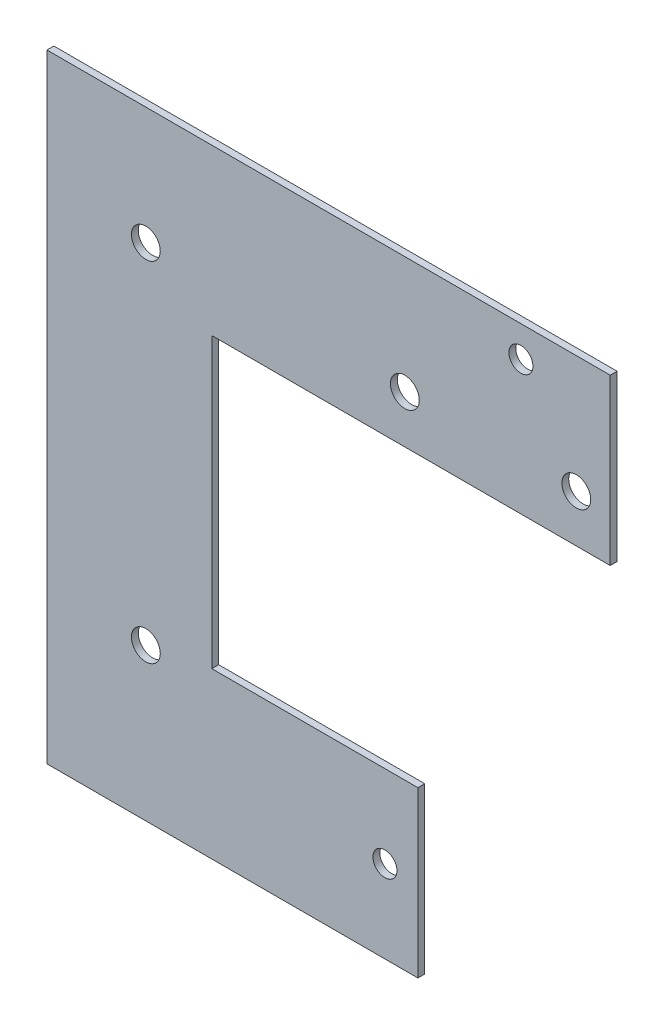
ISO-10303-21;
HEADER;
FILE_DESCRIPTION(('STEP AP214'),'2;1');
FILE_NAME('part.step','',(''),(''),'','','');
FILE_SCHEMA(('AUTOMOTIVE_DESIGN { 1 0 10303 214 1 1 1 1 }'));
ENDSEC;
DATA;
#1=APPLICATION_CONTEXT('core data for automotive mechanical design processes');
#2=APPLICATION_PROTOCOL_DEFINITION('international standard','automotive_design',2000,#1);
#3=PRODUCT_CONTEXT('',#1,'mechanical');
#4=PRODUCT('Part','Part','',(#3));
#5=PRODUCT_RELATED_PRODUCT_CATEGORY('part','',(#4));
#6=PRODUCT_DEFINITION_FORMATION('','',#4);
#7=PRODUCT_DEFINITION_CONTEXT('part definition',#1,'design');
#8=PRODUCT_DEFINITION('design','',#6,#7);
#9=PRODUCT_DEFINITION_SHAPE('','',#8);
#10=(LENGTH_UNIT() NAMED_UNIT(*) SI_UNIT(.MILLI.,.METRE.));
#11=(NAMED_UNIT(*) PLANE_ANGLE_UNIT() SI_UNIT($,.RADIAN.));
#12=(NAMED_UNIT(*) SI_UNIT($,.STERADIAN.) SOLID_ANGLE_UNIT());
#13=UNCERTAINTY_MEASURE_WITH_UNIT(LENGTH_MEASURE(1.E-05),#10,'distance_accuracy_value','');
#14=(GEOMETRIC_REPRESENTATION_CONTEXT(3) GLOBAL_UNCERTAINTY_ASSIGNED_CONTEXT((#13)) GLOBAL_UNIT_ASSIGNED_CONTEXT((#10,
#11,#12)) REPRESENTATION_CONTEXT('',''));
#15=CARTESIAN_POINT('',(0.,0.,0.));
#16=DIRECTION('',(0.,0.,1.));
#17=DIRECTION('',(1.,0.,0.));
#18=AXIS2_PLACEMENT_3D('',#15,#16,#17);
#19=CARTESIAN_POINT('',(-4.99999999999998,-42.,-1.));
#20=DIRECTION('',(0.,1.,0.));
#21=DIRECTION('',(0.,0.,1.));
#22=AXIS2_PLACEMENT_3D('',#19,#20,#21);
#23=PLANE('',#22);
#24=DIRECTION('',(-1.,0.,0.));
#25=VECTOR('',#24,1.);
#26=CARTESIAN_POINT('',(-4.99999999999998,-42.,0.));
#27=LINE('',#26,#25);
#28=CARTESIAN_POINT('',(-4.99999999999998,-42.,0.));
#29=VERTEX_POINT('',#28);
#30=CARTESIAN_POINT('',(-35.,-42.,0.));
#31=VERTEX_POINT('',#30);
#32=EDGE_CURVE('E134',#29,#31,#27,.T.);
#33=ORIENTED_EDGE('',*,*,#32,.F.);
#34=DIRECTION('',(0.,0.,1.));
#35=VECTOR('',#34,1.);
#36=CARTESIAN_POINT('',(-4.99999999999998,-42.,-1.));
#37=LINE('',#36,#35);
#38=CARTESIAN_POINT('',(-4.99999999999998,-42.,-1.));
#39=VERTEX_POINT('',#38);
#40=EDGE_CURVE('E11',#39,#29,#37,.T.);
#41=ORIENTED_EDGE('',*,*,#40,.F.);
#42=DIRECTION('',(-1.,0.,0.));
#43=VECTOR('',#42,1.);
#44=CARTESIAN_POINT('',(-4.99999999999998,-42.,-1.));
#45=LINE('',#44,#43);
#46=CARTESIAN_POINT('',(-35.,-42.,-1.));
#47=VERTEX_POINT('',#46);
#48=EDGE_CURVE('E155',#39,#47,#45,.T.);
#49=ORIENTED_EDGE('',*,*,#48,.T.);
#50=DIRECTION('',(0.,0.,1.));
#51=VECTOR('',#50,1.);
#52=CARTESIAN_POINT('',(-35.,-42.,-1.));
#53=LINE('',#52,#51);
#54=EDGE_CURVE('E40',#47,#31,#53,.T.);
#55=ORIENTED_EDGE('',*,*,#54,.T.);
#56=EDGE_LOOP('',(#33,#41,#49,#55));
#57=FACE_BOUND('',#56,.T.);
#58=ADVANCED_FACE('F37',(#57),#23,.T.);
#59=CARTESIAN_POINT('',(-4.99999999999998,-66.,-1.));
#60=DIRECTION('',(1.,0.,0.));
#61=DIRECTION('',(0.,0.,-1.));
#62=AXIS2_PLACEMENT_3D('',#59,#60,#61);
#63=PLANE('',#62);
#64=DIRECTION('',(0.,1.,0.));
#65=VECTOR('',#64,1.);
#66=CARTESIAN_POINT('',(-4.99999999999998,-66.,0.));
#67=LINE('',#66,#65);
#68=CARTESIAN_POINT('',(-4.99999999999998,-66.,0.));
#69=VERTEX_POINT('',#68);
#70=EDGE_CURVE('E153',#69,#29,#67,.T.);
#71=ORIENTED_EDGE('',*,*,#70,.F.);
#72=DIRECTION('',(0.,0.,1.));
#73=VECTOR('',#72,1.);
#74=CARTESIAN_POINT('',(-4.99999999999998,-66.,-1.));
#75=LINE('',#74,#73);
#76=CARTESIAN_POINT('',(-4.99999999999998,-66.,-1.));
#77=VERTEX_POINT('',#76);
#78=EDGE_CURVE('E46',#77,#69,#75,.T.);
#79=ORIENTED_EDGE('',*,*,#78,.F.);
#80=DIRECTION('',(0.,1.,0.));
#81=VECTOR('',#80,1.);
#82=CARTESIAN_POINT('',(-4.99999999999998,-66.,-1.));
#83=LINE('',#82,#81);
#84=EDGE_CURVE('E123',#77,#39,#83,.T.);
#85=ORIENTED_EDGE('',*,*,#84,.T.);
#86=ORIENTED_EDGE('',*,*,#40,.T.);
#87=EDGE_LOOP('',(#71,#79,#85,#86));
#88=FACE_BOUND('',#87,.T.);
#89=ADVANCED_FACE('F168',(#88),#63,.T.);
#90=CARTESIAN_POINT('',(-35.,-66.,-1.));
#91=DIRECTION('',(0.,-1.,0.));
#92=DIRECTION('',(0.,0.,-1.));
#93=AXIS2_PLACEMENT_3D('',#90,#91,#92);
#94=PLANE('',#93);
#95=DIRECTION('',(1.,0.,0.));
#96=VECTOR('',#95,1.);
#97=CARTESIAN_POINT('',(-35.,-66.,0.));
#98=LINE('',#97,#96);
#99=CARTESIAN_POINT('',(-59.,-66.,0.));
#100=VERTEX_POINT('',#99);
#101=EDGE_CURVE('E110',#100,#69,#98,.T.);
#102=ORIENTED_EDGE('',*,*,#101,.F.);
#103=DIRECTION('',(0.,0.,1.));
#104=VECTOR('',#103,1.);
#105=CARTESIAN_POINT('',(-59.,-66.,-1.));
#106=LINE('',#105,#104);
#107=CARTESIAN_POINT('',(-59.,-66.,-1.));
#108=VERTEX_POINT('',#107);
#109=EDGE_CURVE('E106',#108,#100,#106,.T.);
#110=ORIENTED_EDGE('',*,*,#109,.F.);
#111=DIRECTION('',(1.,0.,0.));
#112=VECTOR('',#111,1.);
#113=CARTESIAN_POINT('',(-35.,-66.,-1.));
#114=LINE('',#113,#112);
#115=EDGE_CURVE('E109',#108,#77,#114,.T.);
#116=ORIENTED_EDGE('',*,*,#115,.T.);
#117=ORIENTED_EDGE('',*,*,#78,.T.);
#118=EDGE_LOOP('',(#102,#110,#116,#117));
#119=FACE_BOUND('',#118,.T.);
#120=ADVANCED_FACE('F108',(#119),#94,.T.);
#121=CARTESIAN_POINT('',(-59.,24.,-1.));
#122=DIRECTION('',(-1.,0.,0.));
#123=DIRECTION('',(0.,-1.,0.));
#124=AXIS2_PLACEMENT_3D('',#121,#122,#123);
#125=PLANE('',#124);
#126=DIRECTION('',(0.,-1.,0.));
#127=VECTOR('',#126,1.);
#128=CARTESIAN_POINT('',(-59.,24.,0.));
#129=LINE('',#128,#127);
#130=CARTESIAN_POINT('',(-59.,24.,0.));
#131=VERTEX_POINT('',#130);
#132=EDGE_CURVE('E150',#131,#100,#129,.T.);
#133=ORIENTED_EDGE('',*,*,#132,.F.);
#134=DIRECTION('',(0.,0.,1.));
#135=VECTOR('',#134,1.);
#136=CARTESIAN_POINT('',(-59.,24.,-1.));
#137=LINE('',#136,#135);
#138=CARTESIAN_POINT('',(-59.,24.,-1.));
#139=VERTEX_POINT('',#138);
#140=EDGE_CURVE('E115',#139,#131,#137,.T.);
#141=ORIENTED_EDGE('',*,*,#140,.F.);
#142=DIRECTION('',(0.,-1.,0.));
#143=VECTOR('',#142,1.);
#144=CARTESIAN_POINT('',(-59.,24.,-1.));
#145=LINE('',#144,#143);
#146=EDGE_CURVE('E122',#139,#108,#145,.T.);
#147=ORIENTED_EDGE('',*,*,#146,.T.);
#148=ORIENTED_EDGE('',*,*,#109,.T.);
#149=EDGE_LOOP('',(#133,#141,#147,#148));
#150=FACE_BOUND('',#149,.T.);
#151=ADVANCED_FACE('F126',(#150),#125,.T.);
#152=CARTESIAN_POINT('',(0.,24.,-1.));
#153=DIRECTION('',(0.,1.,0.));
#154=DIRECTION('',(-1.,0.,0.));
#155=AXIS2_PLACEMENT_3D('',#152,#153,#154);
#156=PLANE('',#155);
#157=DIRECTION('',(-1.,0.,0.));
#158=VECTOR('',#157,1.);
#159=CARTESIAN_POINT('',(0.,24.,0.));
#160=LINE('',#159,#158);
#161=CARTESIAN_POINT('',(23.,24.,0.));
#162=VERTEX_POINT('',#161);
#163=EDGE_CURVE('E147',#162,#131,#160,.T.);
#164=ORIENTED_EDGE('',*,*,#163,.F.);
#165=DIRECTION('',(0.,0.,1.));
#166=VECTOR('',#165,1.);
#167=CARTESIAN_POINT('',(23.,24.,-1.));
#168=LINE('',#167,#166);
#169=CARTESIAN_POINT('',(23.,24.,-1.));
#170=VERTEX_POINT('',#169);
#171=EDGE_CURVE('E159',#170,#162,#168,.T.);
#172=ORIENTED_EDGE('',*,*,#171,.F.);
#173=DIRECTION('',(-1.,0.,0.));
#174=VECTOR('',#173,1.);
#175=CARTESIAN_POINT('',(23.,24.,-1.));
#176=LINE('',#175,#174);
#177=EDGE_CURVE('E127',#170,#139,#176,.T.);
#178=ORIENTED_EDGE('',*,*,#177,.T.);
#179=ORIENTED_EDGE('',*,*,#140,.T.);
#180=EDGE_LOOP('',(#164,#172,#178,#179));
#181=FACE_BOUND('',#180,.T.);
#182=ADVANCED_FACE('F181',(#181),#156,.T.);
#183=CARTESIAN_POINT('',(23.,0.,-1.));
#184=DIRECTION('',(1.,0.,0.));
#185=DIRECTION('',(0.,1.,0.));
#186=AXIS2_PLACEMENT_3D('',#183,#184,#185);
#187=PLANE('',#186);
#188=DIRECTION('',(0.,1.,0.));
#189=VECTOR('',#188,1.);
#190=CARTESIAN_POINT('',(23.,0.,0.));
#191=LINE('',#190,#189);
#192=CARTESIAN_POINT('',(23.,0.,0.));
#193=VERTEX_POINT('',#192);
#194=EDGE_CURVE('E144',#193,#162,#191,.T.);
#195=ORIENTED_EDGE('',*,*,#194,.F.);
#196=DIRECTION('',(0.,0.,1.));
#197=VECTOR('',#196,1.);
#198=CARTESIAN_POINT('',(23.,0.,-1.));
#199=LINE('',#198,#197);
#200=CARTESIAN_POINT('',(23.,0.,-1.));
#201=VERTEX_POINT('',#200);
#202=EDGE_CURVE('E162',#201,#193,#199,.T.);
#203=ORIENTED_EDGE('',*,*,#202,.F.);
#204=DIRECTION('',(0.,1.,0.));
#205=VECTOR('',#204,1.);
#206=CARTESIAN_POINT('',(23.,0.,-1.));
#207=LINE('',#206,#205);
#208=EDGE_CURVE('E129',#201,#170,#207,.T.);
#209=ORIENTED_EDGE('',*,*,#208,.T.);
#210=ORIENTED_EDGE('',*,*,#171,.T.);
#211=EDGE_LOOP('',(#195,#203,#209,#210));
#212=FACE_BOUND('',#211,.T.);
#213=ADVANCED_FACE('F184',(#212),#187,.T.);
#214=CARTESIAN_POINT('',(-35.,0.,-1.));
#215=DIRECTION('',(0.,-1.,0.));
#216=DIRECTION('',(1.,0.,0.));
#217=AXIS2_PLACEMENT_3D('',#214,#215,#216);
#218=PLANE('',#217);
#219=DIRECTION('',(1.,0.,0.));
#220=VECTOR('',#219,1.);
#221=CARTESIAN_POINT('',(-35.,0.,0.));
#222=LINE('',#221,#220);
#223=CARTESIAN_POINT('',(-35.,0.,0.));
#224=VERTEX_POINT('',#223);
#225=EDGE_CURVE('E141',#224,#193,#222,.T.);
#226=ORIENTED_EDGE('',*,*,#225,.F.);
#227=DIRECTION('',(0.,0.,1.));
#228=VECTOR('',#227,1.);
#229=CARTESIAN_POINT('',(-35.,0.,-1.));
#230=LINE('',#229,#228);
#231=CARTESIAN_POINT('',(-35.,0.,-1.));
#232=VERTEX_POINT('',#231);
#233=EDGE_CURVE('E163',#232,#224,#230,.T.);
#234=ORIENTED_EDGE('',*,*,#233,.F.);
#235=DIRECTION('',(1.,0.,0.));
#236=VECTOR('',#235,1.);
#237=CARTESIAN_POINT('',(-35.,0.,-1.));
#238=LINE('',#237,#236);
#239=EDGE_CURVE('E270',#232,#201,#238,.T.);
#240=ORIENTED_EDGE('',*,*,#239,.T.);
#241=ORIENTED_EDGE('',*,*,#202,.T.);
#242=EDGE_LOOP('',(#226,#234,#240,#241));
#243=FACE_BOUND('',#242,.T.);
#244=ADVANCED_FACE('F188',(#243),#218,.T.);
#245=CARTESIAN_POINT('',(-35.,0.,-1.));
#246=DIRECTION('',(1.,0.,0.));
#247=DIRECTION('',(0.,1.,0.));
#248=AXIS2_PLACEMENT_3D('',#245,#246,#247);
#249=PLANE('',#248);
#250=DIRECTION('',(0.,1.,0.));
#251=VECTOR('',#250,1.);
#252=CARTESIAN_POINT('',(-35.,0.,0.));
#253=LINE('',#252,#251);
#254=EDGE_CURVE('E137',#31,#224,#253,.T.);
#255=ORIENTED_EDGE('',*,*,#254,.F.);
#256=ORIENTED_EDGE('',*,*,#54,.F.);
#257=DIRECTION('',(0.,1.,0.));
#258=VECTOR('',#257,1.);
#259=CARTESIAN_POINT('',(-35.,0.,-1.));
#260=LINE('',#259,#258);
#261=EDGE_CURVE('E268',#47,#232,#260,.T.);
#262=ORIENTED_EDGE('',*,*,#261,.T.);
#263=ORIENTED_EDGE('',*,*,#233,.T.);
#264=EDGE_LOOP('',(#255,#256,#262,#263));
#265=FACE_BOUND('',#264,.T.);
#266=ADVANCED_FACE('F165',(#265),#249,.T.);
#267=CARTESIAN_POINT('',(0.,0.,-1.));
#268=DIRECTION('',(0.,0.,1.));
#269=DIRECTION('',(1.,0.,0.));
#270=AXIS2_PLACEMENT_3D('',#267,#268,#269);
#271=PLANE('',#270);
#272=CARTESIAN_POINT('',(-9.79168050644217,-54.,-0.999999999999999));
#273=DIRECTION('',(0.,0.,1.));
#274=DIRECTION('',(1.,0.,0.));
#275=AXIS2_PLACEMENT_3D('',#272,#273,#274);
#276=CIRCLE('',#275,1.75);
#277=CARTESIAN_POINT('',(-8.04168050644217,-54.,-0.999999999999999));
#278=VERTEX_POINT('',#277);
#279=EDGE_CURVE('E234',#278,#278,#276,.T.);
#280=ORIENTED_EDGE('',*,*,#279,.T.);
#281=EDGE_LOOP('',(#280));
#282=FACE_BOUND('',#281,.T.);
#283=CARTESIAN_POINT('',(10.0021521370696,19.5,-1.));
#284=DIRECTION('',(0.,0.,1.));
#285=DIRECTION('',(1.,0.,0.));
#286=AXIS2_PLACEMENT_3D('',#283,#284,#285);
#287=CIRCLE('',#286,1.75);
#288=CARTESIAN_POINT('',(11.7521521370696,19.5,-1.));
#289=VERTEX_POINT('',#288);
#290=EDGE_CURVE('E138',#289,#289,#287,.T.);
#291=ORIENTED_EDGE('',*,*,#290,.T.);
#292=EDGE_LOOP('',(#291));
#293=FACE_BOUND('',#292,.T.);
#294=CARTESIAN_POINT('',(-6.89676086609532,6.94257258609672,-1.));
#295=DIRECTION('',(0.,0.,1.));
#296=DIRECTION('',(1.,0.,0.));
#297=AXIS2_PLACEMENT_3D('',#294,#295,#296);
#298=CIRCLE('',#297,2.1);
#299=CARTESIAN_POINT('',(-4.79676086609532,6.94257258609672,-1.));
#300=VERTEX_POINT('',#299);
#301=EDGE_CURVE('E262',#300,#300,#298,.T.);
#302=ORIENTED_EDGE('',*,*,#301,.T.);
#303=EDGE_LOOP('',(#302));
#304=FACE_BOUND('',#303,.T.);
#305=CARTESIAN_POINT('',(-44.6005894139996,6.8925725861892,-1.));
#306=DIRECTION('',(0.,0.,1.));
#307=DIRECTION('',(1.,0.,0.));
#308=AXIS2_PLACEMENT_3D('',#305,#306,#307);
#309=CIRCLE('',#308,2.1);
#310=CARTESIAN_POINT('',(-42.5005894139996,6.8925725861892,-1.));
#311=VERTEX_POINT('',#310);
#312=EDGE_CURVE('E259',#311,#311,#309,.T.);
#313=ORIENTED_EDGE('',*,*,#312,.T.);
#314=EDGE_LOOP('',(#313));
#315=FACE_BOUND('',#314,.T.);
#316=CARTESIAN_POINT('',(-44.6005894139996,-43.8443086677085,-1.));
#317=DIRECTION('',(0.,0.,1.));
#318=DIRECTION('',(1.,0.,0.));
#319=AXIS2_PLACEMENT_3D('',#316,#317,#318);
#320=CIRCLE('',#319,2.10000000000035);
#321=CARTESIAN_POINT('',(-42.5005894139993,-43.8443086677085,-1.));
#322=VERTEX_POINT('',#321);
#323=EDGE_CURVE('E256',#322,#322,#320,.T.);
#324=ORIENTED_EDGE('',*,*,#323,.T.);
#325=EDGE_LOOP('',(#324));
#326=FACE_BOUND('',#325,.T.);
#327=CARTESIAN_POINT('',(18.0605404532417,6.89257258618885,-1.));
#328=DIRECTION('',(0.,0.,1.));
#329=DIRECTION('',(1.,0.,0.));
#330=AXIS2_PLACEMENT_3D('',#327,#328,#329);
#331=CIRCLE('',#330,2.1);
#332=CARTESIAN_POINT('',(20.1605404532418,6.89257258618885,-1.));
#333=VERTEX_POINT('',#332);
#334=EDGE_CURVE('E245',#333,#333,#331,.T.);
#335=ORIENTED_EDGE('',*,*,#334,.T.);
#336=EDGE_LOOP('',(#335));
#337=FACE_BOUND('',#336,.T.);
#338=ORIENTED_EDGE('',*,*,#48,.F.);
#339=ORIENTED_EDGE('',*,*,#84,.F.);
#340=ORIENTED_EDGE('',*,*,#115,.F.);
#341=ORIENTED_EDGE('',*,*,#146,.F.);
#342=ORIENTED_EDGE('',*,*,#177,.F.);
#343=ORIENTED_EDGE('',*,*,#208,.F.);
#344=ORIENTED_EDGE('',*,*,#239,.F.);
#345=ORIENTED_EDGE('',*,*,#261,.F.);
#346=EDGE_LOOP('',(#338,#339,#340,#341,#342,#343,#344,#345));
#347=FACE_BOUND('',#346,.T.);
#348=ADVANCED_FACE('F120',(#282,#293,#304,#315,#326,#337,#347),#271,.F.);
#349=CARTESIAN_POINT('',(0.,0.,0.));
#350=DIRECTION('',(0.,0.,1.));
#351=DIRECTION('',(1.,0.,0.));
#352=AXIS2_PLACEMENT_3D('',#349,#350,#351);
#353=PLANE('',#352);
#354=CARTESIAN_POINT('',(-9.79168050644217,-54.,0.));
#355=DIRECTION('',(0.,0.,1.));
#356=DIRECTION('',(1.,0.,0.));
#357=AXIS2_PLACEMENT_3D('',#354,#355,#356);
#358=CIRCLE('',#357,1.75);
#359=CARTESIAN_POINT('',(-8.04168050644217,-54.,0.));
#360=VERTEX_POINT('',#359);
#361=EDGE_CURVE('E232',#360,#360,#358,.T.);
#362=ORIENTED_EDGE('',*,*,#361,.F.);
#363=EDGE_LOOP('',(#362));
#364=FACE_BOUND('',#363,.T.);
#365=CARTESIAN_POINT('',(10.0021521370696,19.5,0.));
#366=DIRECTION('',(0.,0.,1.));
#367=DIRECTION('',(1.,0.,0.));
#368=AXIS2_PLACEMENT_3D('',#365,#366,#367);
#369=CIRCLE('',#368,1.75);
#370=CARTESIAN_POINT('',(11.7521521370696,19.5,0.));
#371=VERTEX_POINT('',#370);
#372=EDGE_CURVE('E242',#371,#371,#369,.T.);
#373=ORIENTED_EDGE('',*,*,#372,.F.);
#374=EDGE_LOOP('',(#373));
#375=FACE_BOUND('',#374,.T.);
#376=CARTESIAN_POINT('',(-6.89676086609532,6.94257258609672,0.));
#377=DIRECTION('',(0.,0.,1.));
#378=DIRECTION('',(1.,0.,0.));
#379=AXIS2_PLACEMENT_3D('',#376,#377,#378);
#380=CIRCLE('',#379,2.1);
#381=CARTESIAN_POINT('',(-4.79676086609532,6.94257258609672,0.));
#382=VERTEX_POINT('',#381);
#383=EDGE_CURVE('E235',#382,#382,#380,.T.);
#384=ORIENTED_EDGE('',*,*,#383,.F.);
#385=EDGE_LOOP('',(#384));
#386=FACE_BOUND('',#385,.T.);
#387=CARTESIAN_POINT('',(-44.6005894139996,6.8925725861892,0.));
#388=DIRECTION('',(0.,0.,1.));
#389=DIRECTION('',(1.,0.,0.));
#390=AXIS2_PLACEMENT_3D('',#387,#388,#389);
#391=CIRCLE('',#390,2.1);
#392=CARTESIAN_POINT('',(-42.5005894139996,6.8925725861892,0.));
#393=VERTEX_POINT('',#392);
#394=EDGE_CURVE('E238',#393,#393,#391,.T.);
#395=ORIENTED_EDGE('',*,*,#394,.F.);
#396=EDGE_LOOP('',(#395));
#397=FACE_BOUND('',#396,.T.);
#398=CARTESIAN_POINT('',(-44.6005894139996,-43.8443086677085,0.));
#399=DIRECTION('',(0.,0.,1.));
#400=DIRECTION('',(1.,0.,0.));
#401=AXIS2_PLACEMENT_3D('',#398,#399,#400);
#402=CIRCLE('',#401,2.10000000000035);
#403=CARTESIAN_POINT('',(-42.5005894139993,-43.8443086677085,0.));
#404=VERTEX_POINT('',#403);
#405=EDGE_CURVE('E248',#404,#404,#402,.T.);
#406=ORIENTED_EDGE('',*,*,#405,.F.);
#407=EDGE_LOOP('',(#406));
#408=FACE_BOUND('',#407,.T.);
#409=CARTESIAN_POINT('',(18.0605404532417,6.89257258618885,0.));
#410=DIRECTION('',(0.,0.,1.));
#411=DIRECTION('',(1.,0.,0.));
#412=AXIS2_PLACEMENT_3D('',#409,#410,#411);
#413=CIRCLE('',#412,2.1);
#414=CARTESIAN_POINT('',(20.1605404532418,6.89257258618885,0.));
#415=VERTEX_POINT('',#414);
#416=EDGE_CURVE('E246',#415,#415,#413,.T.);
#417=ORIENTED_EDGE('',*,*,#416,.F.);
#418=EDGE_LOOP('',(#417));
#419=FACE_BOUND('',#418,.T.);
#420=ORIENTED_EDGE('',*,*,#32,.T.);
#421=ORIENTED_EDGE('',*,*,#254,.T.);
#422=ORIENTED_EDGE('',*,*,#225,.T.);
#423=ORIENTED_EDGE('',*,*,#194,.T.);
#424=ORIENTED_EDGE('',*,*,#163,.T.);
#425=ORIENTED_EDGE('',*,*,#132,.T.);
#426=ORIENTED_EDGE('',*,*,#101,.T.);
#427=ORIENTED_EDGE('',*,*,#70,.T.);
#428=EDGE_LOOP('',(#420,#421,#422,#423,#424,#425,#426,#427));
#429=FACE_BOUND('',#428,.T.);
#430=ADVANCED_FACE('F167',(#364,#375,#386,#397,#408,#419,#429),#353,.T.);
#431=CARTESIAN_POINT('',(18.0605404532417,6.89257258618885,-40.));
#432=DIRECTION('',(0.,0.,1.));
#433=DIRECTION('',(1.,0.,0.));
#434=AXIS2_PLACEMENT_3D('',#431,#432,#433);
#435=CYLINDRICAL_SURFACE('',#434,2.1);
#436=ORIENTED_EDGE('',*,*,#416,.T.);
#437=EDGE_LOOP('',(#436));
#438=FACE_BOUND('',#437,.T.);
#439=ORIENTED_EDGE('',*,*,#334,.F.);
#440=EDGE_LOOP('',(#439));
#441=FACE_BOUND('',#440,.T.);
#442=ADVANCED_FACE('F200',(#438,#441),#435,.F.);
#443=CARTESIAN_POINT('',(-44.6005894139996,-43.8443086677085,-40.));
#444=DIRECTION('',(0.,0.,1.));
#445=DIRECTION('',(1.,0.,0.));
#446=AXIS2_PLACEMENT_3D('',#443,#444,#445);
#447=CYLINDRICAL_SURFACE('',#446,2.10000000000035);
#448=ORIENTED_EDGE('',*,*,#405,.T.);
#449=EDGE_LOOP('',(#448));
#450=FACE_BOUND('',#449,.T.);
#451=ORIENTED_EDGE('',*,*,#323,.F.);
#452=EDGE_LOOP('',(#451));
#453=FACE_BOUND('',#452,.T.);
#454=ADVANCED_FACE('F205',(#450,#453),#447,.F.);
#455=CARTESIAN_POINT('',(-44.6005894139996,6.8925725861892,-40.));
#456=DIRECTION('',(0.,0.,1.));
#457=DIRECTION('',(1.,0.,0.));
#458=AXIS2_PLACEMENT_3D('',#455,#456,#457);
#459=CYLINDRICAL_SURFACE('',#458,2.1);
#460=ORIENTED_EDGE('',*,*,#394,.T.);
#461=EDGE_LOOP('',(#460));
#462=FACE_BOUND('',#461,.T.);
#463=ORIENTED_EDGE('',*,*,#312,.F.);
#464=EDGE_LOOP('',(#463));
#465=FACE_BOUND('',#464,.T.);
#466=ADVANCED_FACE('F208',(#462,#465),#459,.F.);
#467=CARTESIAN_POINT('',(-6.89676086609532,6.94257258609672,-40.));
#468=DIRECTION('',(0.,0.,1.));
#469=DIRECTION('',(1.,0.,0.));
#470=AXIS2_PLACEMENT_3D('',#467,#468,#469);
#471=CYLINDRICAL_SURFACE('',#470,2.1);
#472=ORIENTED_EDGE('',*,*,#383,.T.);
#473=EDGE_LOOP('',(#472));
#474=FACE_BOUND('',#473,.T.);
#475=ORIENTED_EDGE('',*,*,#301,.F.);
#476=EDGE_LOOP('',(#475));
#477=FACE_BOUND('',#476,.T.);
#478=ADVANCED_FACE('F213',(#474,#477),#471,.F.);
#479=CARTESIAN_POINT('',(10.0021521370696,19.5,-40.));
#480=DIRECTION('',(0.,0.,1.));
#481=DIRECTION('',(1.,0.,0.));
#482=AXIS2_PLACEMENT_3D('',#479,#480,#481);
#483=CYLINDRICAL_SURFACE('',#482,1.75);
#484=ORIENTED_EDGE('',*,*,#372,.T.);
#485=EDGE_LOOP('',(#484));
#486=FACE_BOUND('',#485,.T.);
#487=ORIENTED_EDGE('',*,*,#290,.F.);
#488=EDGE_LOOP('',(#487));
#489=FACE_BOUND('',#488,.T.);
#490=ADVANCED_FACE('F216',(#486,#489),#483,.F.);
#491=CARTESIAN_POINT('',(-9.79168050644217,-54.,-10.));
#492=DIRECTION('',(0.,0.,1.));
#493=DIRECTION('',(1.,0.,0.));
#494=AXIS2_PLACEMENT_3D('',#491,#492,#493);
#495=CYLINDRICAL_SURFACE('',#494,1.75);
#496=ORIENTED_EDGE('',*,*,#361,.T.);
#497=EDGE_LOOP('',(#496));
#498=FACE_BOUND('',#497,.T.);
#499=ORIENTED_EDGE('',*,*,#279,.F.);
#500=EDGE_LOOP('',(#499));
#501=FACE_BOUND('',#500,.T.);
#502=ADVANCED_FACE('F223',(#498,#501),#495,.F.);
#503=CLOSED_SHELL('',(#58,#89,#120,#151,#182,#213,#244,#266,#348,#430,#442,#454,#466,#478,#490,#502));
#504=MANIFOLD_SOLID_BREP('B2',#503);
#505=ADVANCED_BREP_SHAPE_REPRESENTATION('',(#18,#504),#14);
#506=SHAPE_DEFINITION_REPRESENTATION(#9,#505);
ENDSEC;
END-ISO-10303-21;
